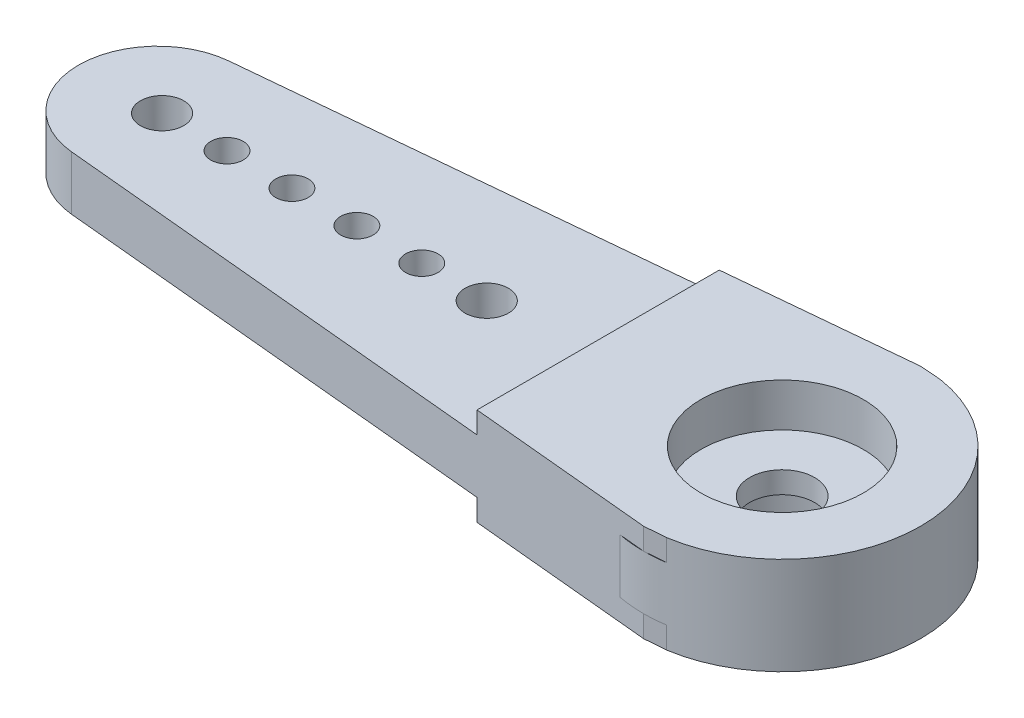
ISO-10303-21;
HEADER;
FILE_DESCRIPTION(('STEP AP214'),'2;1');
FILE_NAME('part.step','',(''),(''),'','','');
FILE_SCHEMA(('AUTOMOTIVE_DESIGN { 1 0 10303 214 1 1 1 1 }'));
ENDSEC;
DATA;
#1=APPLICATION_CONTEXT('core data for automotive mechanical design processes');
#2=APPLICATION_PROTOCOL_DEFINITION('international standard','automotive_design',2000,#1);
#3=PRODUCT_CONTEXT('',#1,'mechanical');
#4=PRODUCT('Part','Part','',(#3));
#5=PRODUCT_RELATED_PRODUCT_CATEGORY('part','',(#4));
#6=PRODUCT_DEFINITION_FORMATION('','',#4);
#7=PRODUCT_DEFINITION_CONTEXT('part definition',#1,'design');
#8=PRODUCT_DEFINITION('design','',#6,#7);
#9=PRODUCT_DEFINITION_SHAPE('','',#8);
#10=(LENGTH_UNIT() NAMED_UNIT(*) SI_UNIT(.MILLI.,.METRE.));
#11=(NAMED_UNIT(*) PLANE_ANGLE_UNIT() SI_UNIT($,.RADIAN.));
#12=(NAMED_UNIT(*) SI_UNIT($,.STERADIAN.) SOLID_ANGLE_UNIT());
#13=UNCERTAINTY_MEASURE_WITH_UNIT(LENGTH_MEASURE(1.E-05),#10,'distance_accuracy_value','');
#14=(GEOMETRIC_REPRESENTATION_CONTEXT(3) GLOBAL_UNCERTAINTY_ASSIGNED_CONTEXT((#13)) GLOBAL_UNIT_ASSIGNED_CONTEXT((#10,
#11,#12)) REPRESENTATION_CONTEXT('',''));
#15=CARTESIAN_POINT('',(0.,0.,0.));
#16=DIRECTION('',(0.,0.,1.));
#17=DIRECTION('',(1.,0.,0.));
#18=AXIS2_PLACEMENT_3D('',#15,#16,#17);
#19=CARTESIAN_POINT('',(28.85,-11.,0.));
#20=DIRECTION('',(0.,1.,0.));
#21=DIRECTION('',(0.,0.,1.));
#22=AXIS2_PLACEMENT_3D('',#19,#20,#21);
#23=CYLINDRICAL_SURFACE('',#22,1.5);
#24=CARTESIAN_POINT('',(28.85,0.5,0.));
#25=DIRECTION('',(0.,-1.,0.));
#26=DIRECTION('',(0.,0.,-1.));
#27=AXIS2_PLACEMENT_3D('',#24,#25,#26);
#28=CIRCLE('',#27,1.5);
#29=CARTESIAN_POINT('',(28.85,0.5,-1.5));
#30=VERTEX_POINT('',#29);
#31=EDGE_CURVE('E299',#30,#30,#28,.F.);
#32=ORIENTED_EDGE('',*,*,#31,.F.);
#33=EDGE_LOOP('',(#32));
#34=FACE_BOUND('',#33,.T.);
#35=CARTESIAN_POINT('',(28.85,1.5,0.));
#36=DIRECTION('',(0.,1.,0.));
#37=DIRECTION('',(0.,0.,1.));
#38=AXIS2_PLACEMENT_3D('',#35,#36,#37);
#39=CIRCLE('',#38,1.5);
#40=CARTESIAN_POINT('',(28.85,1.5,1.5));
#41=VERTEX_POINT('',#40);
#42=EDGE_CURVE('E38',#41,#41,#39,.F.);
#43=ORIENTED_EDGE('',*,*,#42,.F.);
#44=EDGE_LOOP('',(#43));
#45=FACE_BOUND('',#44,.T.);
#46=ADVANCED_FACE('F34',(#34,#45),#23,.F.);
#47=CARTESIAN_POINT('',(0.,2.5,0.));
#48=DIRECTION('',(0.,1.,0.));
#49=DIRECTION('',(0.,0.,1.));
#50=AXIS2_PLACEMENT_3D('',#47,#48,#49);
#51=PLANE('',#50);
#52=CARTESIAN_POINT('',(28.85,2.5,0.));
#53=DIRECTION('',(0.,1.,0.));
#54=DIRECTION('',(0.,0.,1.));
#55=AXIS2_PLACEMENT_3D('',#52,#53,#54);
#56=CIRCLE('',#55,6.40000000000001);
#57=CARTESIAN_POINT('',(28.85,2.5,6.40000000000001));
#58=VERTEX_POINT('',#57);
#59=CARTESIAN_POINT('',(29.8368016849677,2.5,6.32346601434253));
#60=VERTEX_POINT('',#59);
#61=EDGE_CURVE('E242',#58,#60,#56,.T.);
#62=ORIENTED_EDGE('',*,*,#61,.T.);
#63=DIRECTION('',(-0.997005908894481,0.,0.0773254009332646));
#64=VECTOR('',#63,1.);
#65=CARTESIAN_POINT('',(0.665901271094628,2.5,8.58589149243044));
#66=LINE('',#65,#64);
#67=EDGE_CURVE('E156',#60,#58,#66,.T.);
#68=ORIENTED_EDGE('',*,*,#67,.T.);
#69=EDGE_LOOP('',(#62,#68));
#70=FACE_BOUND('',#69,.T.);
#71=ADVANCED_FACE('F338',(#70),#51,.T.);
#72=DIRECTION('',(0.995540849684508,0.,0.0943314189941372));
#73=VECTOR('',#72,1.);
#74=CARTESIAN_POINT('',(-0.344309679328601,2.5,3.63372410134846));
#75=LINE('',#74,#73);
#76=CARTESIAN_POINT('',(27.6479420029777,2.5,6.28610026739908));
#77=VERTEX_POINT('',#76);
#78=EDGE_CURVE('E229',#77,#58,#75,.T.);
#79=ORIENTED_EDGE('',*,*,#78,.F.);
#80=EDGE_CURVE('E238',#77,#58,#56,.T.);
#81=ORIENTED_EDGE('',*,*,#80,.T.);
#82=EDGE_LOOP('',(#79,#81));
#83=FACE_BOUND('',#82,.T.);
#84=ADVANCED_FACE('F421',(#83),#51,.T.);
#85=CARTESIAN_POINT('',(28.85,2.5,-6.40000000000001));
#86=VERTEX_POINT('',#85);
#87=CARTESIAN_POINT('',(27.6479420029777,2.5,-6.28610026739908));
#88=VERTEX_POINT('',#87);
#89=EDGE_CURVE('E236',#86,#88,#56,.T.);
#90=ORIENTED_EDGE('',*,*,#89,.T.);
#91=DIRECTION('',(0.995540849684508,0.,-0.0943314189941372));
#92=VECTOR('',#91,1.);
#93=CARTESIAN_POINT('',(-0.344309679328601,2.5,-3.63372410134846));
#94=LINE('',#93,#92);
#95=EDGE_CURVE('E58',#88,#86,#94,.T.);
#96=ORIENTED_EDGE('',*,*,#95,.T.);
#97=EDGE_LOOP('',(#90,#96));
#98=FACE_BOUND('',#97,.T.);
#99=ADVANCED_FACE('F380',(#98),#51,.T.);
#100=CARTESIAN_POINT('',(29.8368016849677,2.5,-6.32346601434253));
#101=VERTEX_POINT('',#100);
#102=EDGE_CURVE('E378',#101,#86,#56,.T.);
#103=ORIENTED_EDGE('',*,*,#102,.T.);
#104=DIRECTION('',(0.997005908894481,0.,0.0773254009332646));
#105=VECTOR('',#104,1.);
#106=CARTESIAN_POINT('',(0.665901271094628,2.5,-8.58589149243044));
#107=LINE('',#106,#105);
#108=EDGE_CURVE('E210',#86,#101,#107,.T.);
#109=ORIENTED_EDGE('',*,*,#108,.T.);
#110=EDGE_LOOP('',(#103,#109));
#111=FACE_BOUND('',#110,.T.);
#112=ADVANCED_FACE('F339',(#111),#51,.T.);
#113=CARTESIAN_POINT('',(0.,0.,0.));
#114=DIRECTION('',(0.,1.,0.));
#115=DIRECTION('',(0.,0.,1.));
#116=AXIS2_PLACEMENT_3D('',#113,#114,#115);
#117=PLANE('',#116);
#118=DIRECTION('',(-0.997005908894481,0.,0.0773254009332646));
#119=VECTOR('',#118,1.);
#120=CARTESIAN_POINT('',(0.665901271094628,0.,8.58589149243044));
#121=LINE('',#120,#119);
#122=CARTESIAN_POINT('',(29.8368016849677,0.,6.32346601434253));
#123=VERTEX_POINT('',#122);
#124=CARTESIAN_POINT('',(28.85,0.,6.40000000000001));
#125=VERTEX_POINT('',#124);
#126=EDGE_CURVE('E43',#123,#125,#121,.T.);
#127=ORIENTED_EDGE('',*,*,#126,.F.);
#128=CARTESIAN_POINT('',(28.85,0.,0.));
#129=DIRECTION('',(0.,1.,0.));
#130=DIRECTION('',(0.,0.,1.));
#131=AXIS2_PLACEMENT_3D('',#128,#129,#130);
#132=CIRCLE('',#131,6.40000000000001);
#133=EDGE_CURVE('E253',#125,#123,#132,.T.);
#134=ORIENTED_EDGE('',*,*,#133,.F.);
#135=EDGE_LOOP('',(#127,#134));
#136=FACE_BOUND('',#135,.T.);
#137=ADVANCED_FACE('F354',(#136),#117,.F.);
#138=CARTESIAN_POINT('',(27.6479420029777,0.,6.28610026739908));
#139=VERTEX_POINT('',#138);
#140=EDGE_CURVE('E250',#139,#125,#132,.T.);
#141=ORIENTED_EDGE('',*,*,#140,.F.);
#142=DIRECTION('',(0.995540849684508,0.,0.0943314189941372));
#143=VECTOR('',#142,1.);
#144=CARTESIAN_POINT('',(-0.344309679328601,0.,3.63372410134846));
#145=LINE('',#144,#143);
#146=EDGE_CURVE('E276',#139,#125,#145,.T.);
#147=ORIENTED_EDGE('',*,*,#146,.T.);
#148=EDGE_LOOP('',(#141,#147));
#149=FACE_BOUND('',#148,.T.);
#150=ADVANCED_FACE('F408',(#149),#117,.F.);
#151=DIRECTION('',(0.995540849684508,0.,-0.0943314189941372));
#152=VECTOR('',#151,1.);
#153=CARTESIAN_POINT('',(-0.344309679328601,0.,-3.63372410134846));
#154=LINE('',#153,#152);
#155=CARTESIAN_POINT('',(27.6479420029777,0.,-6.28610026739908));
#156=VERTEX_POINT('',#155);
#157=CARTESIAN_POINT('',(28.85,0.,-6.40000000000001));
#158=VERTEX_POINT('',#157);
#159=EDGE_CURVE('E271',#156,#158,#154,.T.);
#160=ORIENTED_EDGE('',*,*,#159,.F.);
#161=EDGE_CURVE('E249',#158,#156,#132,.T.);
#162=ORIENTED_EDGE('',*,*,#161,.F.);
#163=EDGE_LOOP('',(#160,#162));
#164=FACE_BOUND('',#163,.T.);
#165=ADVANCED_FACE('F394',(#164),#117,.F.);
#166=DIRECTION('',(0.997005908894481,0.,0.0773254009332646));
#167=VECTOR('',#166,1.);
#168=CARTESIAN_POINT('',(0.665901271094628,0.,-8.58589149243044));
#169=LINE('',#168,#167);
#170=CARTESIAN_POINT('',(29.8368016849677,0.,-6.32346601434253));
#171=VERTEX_POINT('',#170);
#172=EDGE_CURVE('E268',#158,#171,#169,.T.);
#173=ORIENTED_EDGE('',*,*,#172,.F.);
#174=EDGE_CURVE('E393',#171,#158,#132,.T.);
#175=ORIENTED_EDGE('',*,*,#174,.F.);
#176=EDGE_LOOP('',(#173,#175));
#177=FACE_BOUND('',#176,.T.);
#178=ADVANCED_FACE('F355',(#177),#117,.F.);
#179=CARTESIAN_POINT('',(-0.344309679328601,2.5,3.63372410134846));
#180=DIRECTION('',(-0.0943314189941372,0.,0.995540849684508));
#181=DIRECTION('',(0.995540849684508,0.,0.0943314189941372));
#182=AXIS2_PLACEMENT_3D('',#179,#180,#181);
#183=PLANE('',#182);
#184=DIRECTION('',(-0.995540849684508,0.,-0.0943314189941372));
#185=VECTOR('',#184,1.);
#186=CARTESIAN_POINT('',(-0.344309679328601,0.,3.63372410134846));
#187=LINE('',#186,#185);
#188=CARTESIAN_POINT('',(20.35,0.,5.59459150098737));
#189=VERTEX_POINT('',#188);
#190=CARTESIAN_POINT('',(-0.344309679328601,0.,3.63372410134846));
#191=VERTEX_POINT('',#190);
#192=EDGE_CURVE('E233',#189,#191,#187,.T.);
#193=ORIENTED_EDGE('',*,*,#192,.F.);
#194=DIRECTION('',(0.,1.,0.));
#195=VECTOR('',#194,1.);
#196=CARTESIAN_POINT('',(20.35,-1.,5.59459150098737));
#197=LINE('',#196,#195);
#198=CARTESIAN_POINT('',(20.35,-1.,5.59459150098737));
#199=VERTEX_POINT('',#198);
#200=EDGE_CURVE('E212',#199,#189,#197,.T.);
#201=ORIENTED_EDGE('',*,*,#200,.F.);
#202=DIRECTION('',(0.995540849684508,0.,0.0943314189941372));
#203=VECTOR('',#202,1.);
#204=CARTESIAN_POINT('',(-0.344309679328601,-1.,3.63372410134846));
#205=LINE('',#204,#203);
#206=CARTESIAN_POINT('',(28.85,-1.,6.40000000000001));
#207=VERTEX_POINT('',#206);
#208=EDGE_CURVE('E160',#199,#207,#205,.T.);
#209=ORIENTED_EDGE('',*,*,#208,.T.);
#210=DIRECTION('',(0.,1.,0.));
#211=VECTOR('',#210,1.);
#212=CARTESIAN_POINT('',(28.85,-1.,6.40000000000001));
#213=LINE('',#212,#211);
#214=EDGE_CURVE('E207',#207,#125,#213,.T.);
#215=ORIENTED_EDGE('',*,*,#214,.T.);
#216=ORIENTED_EDGE('',*,*,#146,.F.);
#217=DIRECTION('',(0.,-1.,0.));
#218=VECTOR('',#217,1.);
#219=CARTESIAN_POINT('',(27.6479420029777,2.5,6.28610026739908));
#220=LINE('',#219,#218);
#221=EDGE_CURVE('E265',#77,#139,#220,.T.);
#222=ORIENTED_EDGE('',*,*,#221,.F.);
#223=ORIENTED_EDGE('',*,*,#78,.T.);
#224=CARTESIAN_POINT('',(28.85,3.5,6.40000000000001));
#225=VERTEX_POINT('',#224);
#226=EDGE_CURVE('E211',#58,#225,#213,.T.);
#227=ORIENTED_EDGE('',*,*,#226,.T.);
#228=DIRECTION('',(0.995540849684508,0.,0.0943314189941372));
#229=VECTOR('',#228,1.);
#230=CARTESIAN_POINT('',(-0.344309679328601,3.5,3.63372410134846));
#231=LINE('',#230,#229);
#232=CARTESIAN_POINT('',(20.35,3.5,5.59459150098737));
#233=VERTEX_POINT('',#232);
#234=EDGE_CURVE('E177',#233,#225,#231,.T.);
#235=ORIENTED_EDGE('',*,*,#234,.F.);
#236=CARTESIAN_POINT('',(20.35,2.5,5.59459150098737));
#237=VERTEX_POINT('',#236);
#238=EDGE_CURVE('E214',#237,#233,#197,.T.);
#239=ORIENTED_EDGE('',*,*,#238,.F.);
#240=DIRECTION('',(-0.995540849684508,0.,-0.0943314189941372));
#241=VECTOR('',#240,1.);
#242=CARTESIAN_POINT('',(-0.344309679328601,2.5,3.63372410134846));
#243=LINE('',#242,#241);
#244=CARTESIAN_POINT('',(-0.344309679328601,2.5,3.63372410134846));
#245=VERTEX_POINT('',#244);
#246=EDGE_CURVE('E234',#237,#245,#243,.T.);
#247=ORIENTED_EDGE('',*,*,#246,.T.);
#248=DIRECTION('',(0.,-1.,0.));
#249=VECTOR('',#248,1.);
#250=CARTESIAN_POINT('',(-0.344309679328601,2.5,3.63372410134846));
#251=LINE('',#250,#249);
#252=EDGE_CURVE('E247',#245,#191,#251,.T.);
#253=ORIENTED_EDGE('',*,*,#252,.T.);
#254=EDGE_LOOP('',(#193,#201,#209,#215,#216,#222,#223,#227,#235,#239,#247,#253));
#255=FACE_BOUND('',#254,.T.);
#256=ADVANCED_FACE('F36',(#255),#183,.T.);
#257=CARTESIAN_POINT('',(28.85,2.5,0.));
#258=DIRECTION('',(0.,-1.,0.));
#259=DIRECTION('',(0.,0.,-1.));
#260=AXIS2_PLACEMENT_3D('',#257,#258,#259);
#261=CYLINDRICAL_SURFACE('',#260,6.40000000000001);
#262=ORIENTED_EDGE('',*,*,#140,.T.);
#263=ORIENTED_EDGE('',*,*,#133,.T.);
#264=DIRECTION('',(0.,1.,0.));
#265=VECTOR('',#264,1.);
#266=CARTESIAN_POINT('',(29.8368016849677,-1.,6.32346601434253));
#267=LINE('',#266,#265);
#268=CARTESIAN_POINT('',(29.8368016849677,-1.,6.32346601434253));
#269=VERTEX_POINT('',#268);
#270=EDGE_CURVE('E159',#269,#123,#267,.T.);
#271=ORIENTED_EDGE('',*,*,#270,.F.);
#272=CARTESIAN_POINT('',(28.85,-1.,0.));
#273=DIRECTION('',(0.,1.,0.));
#274=DIRECTION('',(0.,0.,1.));
#275=AXIS2_PLACEMENT_3D('',#272,#273,#274);
#276=CIRCLE('',#275,6.40000000000001);
#277=CARTESIAN_POINT('',(29.8368016849677,-1.,-6.32346601434253));
#278=VERTEX_POINT('',#277);
#279=EDGE_CURVE('E195',#269,#278,#276,.T.);
#280=ORIENTED_EDGE('',*,*,#279,.T.);
#281=DIRECTION('',(0.,1.,0.));
#282=VECTOR('',#281,1.);
#283=CARTESIAN_POINT('',(29.8368016849677,-1.,-6.32346601434253));
#284=LINE('',#283,#282);
#285=EDGE_CURVE('E223',#278,#171,#284,.T.);
#286=ORIENTED_EDGE('',*,*,#285,.T.);
#287=ORIENTED_EDGE('',*,*,#174,.T.);
#288=ORIENTED_EDGE('',*,*,#161,.T.);
#289=DIRECTION('',(0.,-1.,0.));
#290=VECTOR('',#289,1.);
#291=CARTESIAN_POINT('',(27.6479420029777,2.5,-6.28610026739908));
#292=LINE('',#291,#290);
#293=EDGE_CURVE('E262',#88,#156,#292,.T.);
#294=ORIENTED_EDGE('',*,*,#293,.F.);
#295=ORIENTED_EDGE('',*,*,#89,.F.);
#296=ORIENTED_EDGE('',*,*,#102,.F.);
#297=CARTESIAN_POINT('',(29.8368016849677,3.5,-6.32346601434253));
#298=VERTEX_POINT('',#297);
#299=EDGE_CURVE('E167',#101,#298,#284,.T.);
#300=ORIENTED_EDGE('',*,*,#299,.T.);
#301=CARTESIAN_POINT('',(28.85,3.5,0.));
#302=DIRECTION('',(0.,1.,0.));
#303=DIRECTION('',(0.,0.,1.));
#304=AXIS2_PLACEMENT_3D('',#301,#302,#303);
#305=CIRCLE('',#304,6.40000000000001);
#306=CARTESIAN_POINT('',(29.8368016849677,3.5,6.32346601434253));
#307=VERTEX_POINT('',#306);
#308=EDGE_CURVE('E163',#307,#298,#305,.T.);
#309=ORIENTED_EDGE('',*,*,#308,.F.);
#310=EDGE_CURVE('E150',#60,#307,#267,.T.);
#311=ORIENTED_EDGE('',*,*,#310,.F.);
#312=ORIENTED_EDGE('',*,*,#61,.F.);
#313=ORIENTED_EDGE('',*,*,#80,.F.);
#314=ORIENTED_EDGE('',*,*,#221,.T.);
#315=EDGE_LOOP('',(#262,#263,#271,#280,#286,#287,#288,#294,#295,#296,#300,#309,#311,#312,#313,#314));
#316=FACE_BOUND('',#315,.T.);
#317=ADVANCED_FACE('F165',(#316),#261,.T.);
#318=CARTESIAN_POINT('',(-0.344309679328601,2.5,-3.63372410134846));
#319=DIRECTION('',(0.0943314189941372,0.,0.995540849684508));
#320=DIRECTION('',(0.995540849684508,0.,-0.0943314189941372));
#321=AXIS2_PLACEMENT_3D('',#318,#319,#320);
#322=PLANE('',#321);
#323=DIRECTION('',(-0.995540849684508,0.,0.0943314189941372));
#324=VECTOR('',#323,1.);
#325=CARTESIAN_POINT('',(-0.344309679328601,2.5,-3.63372410134846));
#326=LINE('',#325,#324);
#327=CARTESIAN_POINT('',(20.35,2.5,-5.59459150098737));
#328=VERTEX_POINT('',#327);
#329=CARTESIAN_POINT('',(-0.3443096793286,2.5,-3.63372410134846));
#330=VERTEX_POINT('',#329);
#331=EDGE_CURVE('E241',#328,#330,#326,.T.);
#332=ORIENTED_EDGE('',*,*,#331,.F.);
#333=DIRECTION('',(0.,1.,0.));
#334=VECTOR('',#333,1.);
#335=CARTESIAN_POINT('',(20.35,-1.,-5.59459150098737));
#336=LINE('',#335,#334);
#337=CARTESIAN_POINT('',(20.35,3.5,-5.59459150098737));
#338=VERTEX_POINT('',#337);
#339=EDGE_CURVE('E218',#328,#338,#336,.T.);
#340=ORIENTED_EDGE('',*,*,#339,.T.);
#341=DIRECTION('',(0.995540849684508,0.,-0.0943314189941372));
#342=VECTOR('',#341,1.);
#343=CARTESIAN_POINT('',(-0.344309679328601,3.5,-3.63372410134846));
#344=LINE('',#343,#342);
#345=CARTESIAN_POINT('',(28.85,3.5,-6.40000000000001));
#346=VERTEX_POINT('',#345);
#347=EDGE_CURVE('E187',#338,#346,#344,.T.);
#348=ORIENTED_EDGE('',*,*,#347,.T.);
#349=DIRECTION('',(0.,1.,0.));
#350=VECTOR('',#349,1.);
#351=CARTESIAN_POINT('',(28.85,-1.,-6.40000000000001));
#352=LINE('',#351,#350);
#353=EDGE_CURVE('E222',#86,#346,#352,.T.);
#354=ORIENTED_EDGE('',*,*,#353,.F.);
#355=ORIENTED_EDGE('',*,*,#95,.F.);
#356=ORIENTED_EDGE('',*,*,#293,.T.);
#357=ORIENTED_EDGE('',*,*,#159,.T.);
#358=CARTESIAN_POINT('',(28.85,-1.,-6.40000000000001));
#359=VERTEX_POINT('',#358);
#360=EDGE_CURVE('E219',#359,#158,#352,.T.);
#361=ORIENTED_EDGE('',*,*,#360,.F.);
#362=DIRECTION('',(0.995540849684508,0.,-0.0943314189941372));
#363=VECTOR('',#362,1.);
#364=CARTESIAN_POINT('',(-0.344309679328601,-1.,-3.63372410134846));
#365=LINE('',#364,#363);
#366=CARTESIAN_POINT('',(20.35,-1.,-5.59459150098737));
#367=VERTEX_POINT('',#366);
#368=EDGE_CURVE('E200',#367,#359,#365,.T.);
#369=ORIENTED_EDGE('',*,*,#368,.F.);
#370=CARTESIAN_POINT('',(20.35,0.,-5.59459150098737));
#371=VERTEX_POINT('',#370);
#372=EDGE_CURVE('E215',#367,#371,#336,.T.);
#373=ORIENTED_EDGE('',*,*,#372,.T.);
#374=DIRECTION('',(-0.995540849684508,0.,0.0943314189941372));
#375=VECTOR('',#374,1.);
#376=CARTESIAN_POINT('',(-0.344309679328601,0.,-3.63372410134846));
#377=LINE('',#376,#375);
#378=CARTESIAN_POINT('',(-0.3443096793286,0.,-3.63372410134846));
#379=VERTEX_POINT('',#378);
#380=EDGE_CURVE('E252',#371,#379,#377,.T.);
#381=ORIENTED_EDGE('',*,*,#380,.T.);
#382=DIRECTION('',(0.,-1.,0.));
#383=VECTOR('',#382,1.);
#384=CARTESIAN_POINT('',(-0.3443096793286,2.5,-3.63372410134846));
#385=LINE('',#384,#383);
#386=EDGE_CURVE('E259',#330,#379,#385,.T.);
#387=ORIENTED_EDGE('',*,*,#386,.F.);
#388=EDGE_LOOP('',(#332,#340,#348,#354,#355,#356,#357,#361,#369,#373,#381,#387));
#389=FACE_BOUND('',#388,.T.);
#390=ADVANCED_FACE('F361',(#389),#322,.F.);
#391=CARTESIAN_POINT('',(0.,2.5,0.));
#392=DIRECTION('',(0.,-1.,0.));
#393=DIRECTION('',(0.,0.,-1.));
#394=AXIS2_PLACEMENT_3D('',#391,#392,#393);
#395=CYLINDRICAL_SURFACE('',#394,3.65);
#396=CARTESIAN_POINT('',(0.,0.,0.));
#397=DIRECTION('',(0.,1.,0.));
#398=DIRECTION('',(0.,0.,1.));
#399=AXIS2_PLACEMENT_3D('',#396,#397,#398);
#400=CIRCLE('',#399,3.65);
#401=EDGE_CURVE('E237',#379,#191,#400,.T.);
#402=ORIENTED_EDGE('',*,*,#401,.T.);
#403=ORIENTED_EDGE('',*,*,#252,.F.);
#404=CARTESIAN_POINT('',(0.,2.5,0.));
#405=DIRECTION('',(0.,1.,0.));
#406=DIRECTION('',(0.,0.,1.));
#407=AXIS2_PLACEMENT_3D('',#404,#405,#406);
#408=CIRCLE('',#407,3.65);
#409=EDGE_CURVE('E244',#330,#245,#408,.T.);
#410=ORIENTED_EDGE('',*,*,#409,.F.);
#411=ORIENTED_EDGE('',*,*,#386,.T.);
#412=EDGE_LOOP('',(#402,#403,#410,#411));
#413=FACE_BOUND('',#412,.T.);
#414=ADVANCED_FACE('F335',(#413),#395,.T.);
#415=CARTESIAN_POINT('',(0.204795613183067,2.5,0.));
#416=DIRECTION('',(0.,1.,0.));
#417=DIRECTION('',(0.,0.,-1.));
#418=AXIS2_PLACEMENT_3D('',#415,#416,#417);
#419=CIRCLE('',#418,0.999999999999998);
#420=CARTESIAN_POINT('',(0.204795613183067,2.5,-0.999999999999998));
#421=VERTEX_POINT('',#420);
#422=EDGE_CURVE('E298',#421,#421,#419,.T.);
#423=ORIENTED_EDGE('',*,*,#422,.F.);
#424=EDGE_LOOP('',(#423));
#425=FACE_BOUND('',#424,.T.);
#426=CARTESIAN_POINT('',(3.20479561318307,2.5,0.));
#427=DIRECTION('',(0.,1.,0.));
#428=DIRECTION('',(0.,0.,-1.));
#429=AXIS2_PLACEMENT_3D('',#426,#427,#428);
#430=CIRCLE('',#429,0.75);
#431=CARTESIAN_POINT('',(3.20479561318307,2.5,-0.749999999999979));
#432=VERTEX_POINT('',#431);
#433=EDGE_CURVE('E295',#432,#432,#430,.T.);
#434=ORIENTED_EDGE('',*,*,#433,.F.);
#435=EDGE_LOOP('',(#434));
#436=FACE_BOUND('',#435,.T.);
#437=CARTESIAN_POINT('',(6.20479561318307,2.5,0.));
#438=DIRECTION('',(0.,1.,0.));
#439=DIRECTION('',(0.,0.,-1.));
#440=AXIS2_PLACEMENT_3D('',#437,#438,#439);
#441=CIRCLE('',#440,0.75);
#442=CARTESIAN_POINT('',(6.20479561318307,2.5,-0.749999999999958));
#443=VERTEX_POINT('',#442);
#444=EDGE_CURVE('E291',#443,#443,#441,.T.);
#445=ORIENTED_EDGE('',*,*,#444,.F.);
#446=EDGE_LOOP('',(#445));
#447=FACE_BOUND('',#446,.T.);
#448=CARTESIAN_POINT('',(9.20479561318307,2.5,0.));
#449=DIRECTION('',(0.,1.,0.));
#450=DIRECTION('',(0.,0.,-1.));
#451=AXIS2_PLACEMENT_3D('',#448,#449,#450);
#452=CIRCLE('',#451,0.75);
#453=CARTESIAN_POINT('',(9.20479561318307,2.5,-0.749999999999937));
#454=VERTEX_POINT('',#453);
#455=EDGE_CURVE('E287',#454,#454,#452,.T.);
#456=ORIENTED_EDGE('',*,*,#455,.F.);
#457=EDGE_LOOP('',(#456));
#458=FACE_BOUND('',#457,.T.);
#459=CARTESIAN_POINT('',(15.2047956131831,2.5,0.));
#460=DIRECTION('',(0.,1.,0.));
#461=DIRECTION('',(0.,0.,1.));
#462=AXIS2_PLACEMENT_3D('',#459,#460,#461);
#463=CIRCLE('',#462,1.);
#464=CARTESIAN_POINT('',(15.2047956131831,2.5,1.00000000000009));
#465=VERTEX_POINT('',#464);
#466=EDGE_CURVE('E283',#465,#465,#463,.T.);
#467=ORIENTED_EDGE('',*,*,#466,.F.);
#468=EDGE_LOOP('',(#467));
#469=FACE_BOUND('',#468,.T.);
#470=CARTESIAN_POINT('',(12.2047956131831,2.5,0.));
#471=DIRECTION('',(0.,1.,0.));
#472=DIRECTION('',(0.,0.,-1.));
#473=AXIS2_PLACEMENT_3D('',#470,#471,#472);
#474=CIRCLE('',#473,0.75);
#475=CARTESIAN_POINT('',(12.2047956131831,2.5,-0.749999999999917));
#476=VERTEX_POINT('',#475);
#477=EDGE_CURVE('E181',#476,#476,#474,.T.);
#478=ORIENTED_EDGE('',*,*,#477,.F.);
#479=EDGE_LOOP('',(#478));
#480=FACE_BOUND('',#479,.T.);
#481=DIRECTION('',(0.,0.,1.));
#482=VECTOR('',#481,1.);
#483=CARTESIAN_POINT('',(20.35,2.5,0.));
#484=LINE('',#483,#482);
#485=EDGE_CURVE('E51',#328,#237,#484,.T.);
#486=ORIENTED_EDGE('',*,*,#485,.F.);
#487=ORIENTED_EDGE('',*,*,#331,.T.);
#488=ORIENTED_EDGE('',*,*,#409,.T.);
#489=ORIENTED_EDGE('',*,*,#246,.F.);
#490=EDGE_LOOP('',(#486,#487,#488,#489));
#491=FACE_BOUND('',#490,.T.);
#492=ADVANCED_FACE('F331',(#425,#436,#447,#458,#469,#480,#491),#51,.T.);
#493=CARTESIAN_POINT('',(0.204795613183067,0.,0.));
#494=DIRECTION('',(0.,1.,0.));
#495=DIRECTION('',(0.,0.,1.));
#496=AXIS2_PLACEMENT_3D('',#493,#494,#495);
#497=CIRCLE('',#496,0.999999999999998);
#498=CARTESIAN_POINT('',(0.204795613183067,0.,0.999999999999998));
#499=VERTEX_POINT('',#498);
#500=EDGE_CURVE('E296',#499,#499,#497,.T.);
#501=ORIENTED_EDGE('',*,*,#500,.T.);
#502=EDGE_LOOP('',(#501));
#503=FACE_BOUND('',#502,.T.);
#504=CARTESIAN_POINT('',(3.20479561318307,0.,0.));
#505=DIRECTION('',(0.,1.,0.));
#506=DIRECTION('',(0.,0.,1.));
#507=AXIS2_PLACEMENT_3D('',#504,#505,#506);
#508=CIRCLE('',#507,0.75);
#509=CARTESIAN_POINT('',(3.20479561318307,0.,0.750000000000021));
#510=VERTEX_POINT('',#509);
#511=EDGE_CURVE('E292',#510,#510,#508,.T.);
#512=ORIENTED_EDGE('',*,*,#511,.T.);
#513=EDGE_LOOP('',(#512));
#514=FACE_BOUND('',#513,.T.);
#515=CARTESIAN_POINT('',(6.20479561318307,0.,0.));
#516=DIRECTION('',(0.,1.,0.));
#517=DIRECTION('',(0.,0.,1.));
#518=AXIS2_PLACEMENT_3D('',#515,#516,#517);
#519=CIRCLE('',#518,0.75);
#520=CARTESIAN_POINT('',(6.20479561318307,0.,0.750000000000042));
#521=VERTEX_POINT('',#520);
#522=EDGE_CURVE('E288',#521,#521,#519,.T.);
#523=ORIENTED_EDGE('',*,*,#522,.T.);
#524=EDGE_LOOP('',(#523));
#525=FACE_BOUND('',#524,.T.);
#526=CARTESIAN_POINT('',(9.20479561318307,0.,0.));
#527=DIRECTION('',(0.,1.,0.));
#528=DIRECTION('',(0.,0.,1.));
#529=AXIS2_PLACEMENT_3D('',#526,#527,#528);
#530=CIRCLE('',#529,0.75);
#531=CARTESIAN_POINT('',(9.20479561318307,0.,0.750000000000063));
#532=VERTEX_POINT('',#531);
#533=EDGE_CURVE('E284',#532,#532,#530,.T.);
#534=ORIENTED_EDGE('',*,*,#533,.T.);
#535=EDGE_LOOP('',(#534));
#536=FACE_BOUND('',#535,.T.);
#537=CARTESIAN_POINT('',(15.2047956131831,0.,0.));
#538=DIRECTION('',(0.,1.,0.));
#539=DIRECTION('',(0.,0.,1.));
#540=AXIS2_PLACEMENT_3D('',#537,#538,#539);
#541=CIRCLE('',#540,1.);
#542=CARTESIAN_POINT('',(15.2047956131831,0.,1.00000000000009));
#543=VERTEX_POINT('',#542);
#544=EDGE_CURVE('E280',#543,#543,#541,.T.);
#545=ORIENTED_EDGE('',*,*,#544,.T.);
#546=EDGE_LOOP('',(#545));
#547=FACE_BOUND('',#546,.T.);
#548=CARTESIAN_POINT('',(12.2047956131831,0.,0.));
#549=DIRECTION('',(0.,1.,0.));
#550=DIRECTION('',(0.,0.,1.));
#551=AXIS2_PLACEMENT_3D('',#548,#549,#550);
#552=CIRCLE('',#551,0.75);
#553=CARTESIAN_POINT('',(12.2047956131831,0.,0.750000000000084));
#554=VERTEX_POINT('',#553);
#555=EDGE_CURVE('E178',#554,#554,#552,.T.);
#556=ORIENTED_EDGE('',*,*,#555,.T.);
#557=EDGE_LOOP('',(#556));
#558=FACE_BOUND('',#557,.T.);
#559=ORIENTED_EDGE('',*,*,#380,.F.);
#560=DIRECTION('',(0.,0.,1.));
#561=VECTOR('',#560,1.);
#562=CARTESIAN_POINT('',(20.35,0.,0.));
#563=LINE('',#562,#561);
#564=EDGE_CURVE('E273',#371,#189,#563,.T.);
#565=ORIENTED_EDGE('',*,*,#564,.T.);
#566=ORIENTED_EDGE('',*,*,#192,.T.);
#567=ORIENTED_EDGE('',*,*,#401,.F.);
#568=EDGE_LOOP('',(#559,#565,#566,#567));
#569=FACE_BOUND('',#568,.T.);
#570=ADVANCED_FACE('F334',(#503,#514,#525,#536,#547,#558,#569),#117,.F.);
#571=CARTESIAN_POINT('',(0.,-1.,0.));
#572=DIRECTION('',(0.,1.,0.));
#573=DIRECTION('',(0.,0.,1.));
#574=AXIS2_PLACEMENT_3D('',#571,#572,#573);
#575=PLANE('',#574);
#576=CARTESIAN_POINT('',(28.85,-1.,0.));
#577=DIRECTION('',(0.,1.,0.));
#578=DIRECTION('',(0.,0.,1.));
#579=AXIS2_PLACEMENT_3D('',#576,#577,#578);
#580=CIRCLE('',#579,4.75);
#581=CARTESIAN_POINT('',(28.85,-1.,4.75));
#582=VERTEX_POINT('',#581);
#583=EDGE_CURVE('E11',#582,#582,#580,.F.);
#584=ORIENTED_EDGE('',*,*,#583,.F.);
#585=EDGE_LOOP('',(#584));
#586=FACE_BOUND('',#585,.T.);
#587=DIRECTION('',(-0.997005908894481,0.,0.0773254009332646));
#588=VECTOR('',#587,1.);
#589=CARTESIAN_POINT('',(0.665901271094628,-1.,8.58589149243044));
#590=LINE('',#589,#588);
#591=EDGE_CURVE('E193',#269,#207,#590,.T.);
#592=ORIENTED_EDGE('',*,*,#591,.T.);
#593=ORIENTED_EDGE('',*,*,#208,.F.);
#594=DIRECTION('',(0.,0.,1.));
#595=VECTOR('',#594,1.);
#596=CARTESIAN_POINT('',(20.35,-1.,0.));
#597=LINE('',#596,#595);
#598=EDGE_CURVE('E202',#367,#199,#597,.T.);
#599=ORIENTED_EDGE('',*,*,#598,.F.);
#600=ORIENTED_EDGE('',*,*,#368,.T.);
#601=DIRECTION('',(0.997005908894481,0.,0.0773254009332646));
#602=VECTOR('',#601,1.);
#603=CARTESIAN_POINT('',(0.665901271094628,-1.,-8.58589149243044));
#604=LINE('',#603,#602);
#605=EDGE_CURVE('E198',#359,#278,#604,.T.);
#606=ORIENTED_EDGE('',*,*,#605,.T.);
#607=ORIENTED_EDGE('',*,*,#279,.F.);
#608=EDGE_LOOP('',(#592,#593,#599,#600,#606,#607));
#609=FACE_BOUND('',#608,.T.);
#610=ADVANCED_FACE('F351',(#586,#609),#575,.F.);
#611=CARTESIAN_POINT('',(0.665901271094628,-1.,-8.58589149243044));
#612=DIRECTION('',(-0.0773254009332646,0.,0.997005908894481));
#613=DIRECTION('',(0.997005908894481,0.,0.0773254009332646));
#614=AXIS2_PLACEMENT_3D('',#611,#612,#613);
#615=PLANE('',#614);
#616=ORIENTED_EDGE('',*,*,#360,.T.);
#617=ORIENTED_EDGE('',*,*,#172,.T.);
#618=ORIENTED_EDGE('',*,*,#285,.F.);
#619=ORIENTED_EDGE('',*,*,#605,.F.);
#620=EDGE_LOOP('',(#616,#617,#618,#619));
#621=FACE_BOUND('',#620,.T.);
#622=ADVANCED_FACE('F389',(#621),#615,.F.);
#623=CARTESIAN_POINT('',(20.35,-1.,0.));
#624=DIRECTION('',(-1.,0.,0.));
#625=DIRECTION('',(0.,0.,1.));
#626=AXIS2_PLACEMENT_3D('',#623,#624,#625);
#627=PLANE('',#626);
#628=ORIENTED_EDGE('',*,*,#564,.F.);
#629=ORIENTED_EDGE('',*,*,#372,.F.);
#630=ORIENTED_EDGE('',*,*,#598,.T.);
#631=ORIENTED_EDGE('',*,*,#200,.T.);
#632=EDGE_LOOP('',(#628,#629,#630,#631));
#633=FACE_BOUND('',#632,.T.);
#634=ADVANCED_FACE('F434',(#633),#627,.T.);
#635=CARTESIAN_POINT('',(0.665901271094628,-1.,8.58589149243044));
#636=DIRECTION('',(-0.0773254009332646,0.,-0.997005908894481));
#637=DIRECTION('',(-0.997005908894481,0.,0.0773254009332646));
#638=AXIS2_PLACEMENT_3D('',#635,#636,#637);
#639=PLANE('',#638);
#640=ORIENTED_EDGE('',*,*,#270,.T.);
#641=ORIENTED_EDGE('',*,*,#126,.T.);
#642=ORIENTED_EDGE('',*,*,#214,.F.);
#643=ORIENTED_EDGE('',*,*,#591,.F.);
#644=EDGE_LOOP('',(#640,#641,#642,#643));
#645=FACE_BOUND('',#644,.T.);
#646=ADVANCED_FACE('F403',(#645),#639,.F.);
#647=ORIENTED_EDGE('',*,*,#67,.F.);
#648=ORIENTED_EDGE('',*,*,#310,.T.);
#649=DIRECTION('',(-0.997005908894481,0.,0.0773254009332646));
#650=VECTOR('',#649,1.);
#651=CARTESIAN_POINT('',(0.665901271094628,3.5,8.58589149243044));
#652=LINE('',#651,#650);
#653=EDGE_CURVE('E155',#307,#225,#652,.T.);
#654=ORIENTED_EDGE('',*,*,#653,.T.);
#655=ORIENTED_EDGE('',*,*,#226,.F.);
#656=EDGE_LOOP('',(#647,#648,#654,#655));
#657=FACE_BOUND('',#656,.T.);
#658=ADVANCED_FACE('F152',(#657),#639,.F.);
#659=ORIENTED_EDGE('',*,*,#339,.F.);
#660=ORIENTED_EDGE('',*,*,#485,.T.);
#661=ORIENTED_EDGE('',*,*,#238,.T.);
#662=DIRECTION('',(0.,0.,1.));
#663=VECTOR('',#662,1.);
#664=CARTESIAN_POINT('',(20.35,3.5,0.));
#665=LINE('',#664,#663);
#666=EDGE_CURVE('E190',#338,#233,#665,.T.);
#667=ORIENTED_EDGE('',*,*,#666,.F.);
#668=EDGE_LOOP('',(#659,#660,#661,#667));
#669=FACE_BOUND('',#668,.T.);
#670=ADVANCED_FACE('F369',(#669),#627,.T.);
#671=ORIENTED_EDGE('',*,*,#108,.F.);
#672=ORIENTED_EDGE('',*,*,#353,.T.);
#673=DIRECTION('',(0.997005908894481,0.,0.0773254009332646));
#674=VECTOR('',#673,1.);
#675=CARTESIAN_POINT('',(0.665901271094628,3.5,-8.58589149243044));
#676=LINE('',#675,#674);
#677=EDGE_CURVE('E171',#346,#298,#676,.T.);
#678=ORIENTED_EDGE('',*,*,#677,.T.);
#679=ORIENTED_EDGE('',*,*,#299,.F.);
#680=EDGE_LOOP('',(#671,#672,#678,#679));
#681=FACE_BOUND('',#680,.T.);
#682=ADVANCED_FACE('F375',(#681),#615,.F.);
#683=CARTESIAN_POINT('',(0.,3.5,0.));
#684=DIRECTION('',(0.,1.,0.));
#685=DIRECTION('',(0.,0.,1.));
#686=AXIS2_PLACEMENT_3D('',#683,#684,#685);
#687=PLANE('',#686);
#688=CARTESIAN_POINT('',(28.85,3.5,0.));
#689=DIRECTION('',(0.,1.,0.));
#690=DIRECTION('',(0.,0.,1.));
#691=AXIS2_PLACEMENT_3D('',#688,#689,#690);
#692=CIRCLE('',#691,3.75000000000001);
#693=CARTESIAN_POINT('',(28.85,3.5,3.75000000000001));
#694=VERTEX_POINT('',#693);
#695=EDGE_CURVE('E315',#694,#694,#692,.T.);
#696=ORIENTED_EDGE('',*,*,#695,.F.);
#697=EDGE_LOOP('',(#696));
#698=FACE_BOUND('',#697,.T.);
#699=ORIENTED_EDGE('',*,*,#653,.F.);
#700=ORIENTED_EDGE('',*,*,#308,.T.);
#701=ORIENTED_EDGE('',*,*,#677,.F.);
#702=ORIENTED_EDGE('',*,*,#347,.F.);
#703=ORIENTED_EDGE('',*,*,#666,.T.);
#704=ORIENTED_EDGE('',*,*,#234,.T.);
#705=EDGE_LOOP('',(#699,#700,#701,#702,#703,#704));
#706=FACE_BOUND('',#705,.T.);
#707=ADVANCED_FACE('F174',(#698,#706),#687,.T.);
#708=CARTESIAN_POINT('',(12.2047956131831,-0.5,0.));
#709=DIRECTION('',(0.,1.,0.));
#710=DIRECTION('',(0.,0.,1.));
#711=AXIS2_PLACEMENT_3D('',#708,#709,#710);
#712=CYLINDRICAL_SURFACE('',#711,0.75);
#713=ORIENTED_EDGE('',*,*,#477,.T.);
#714=EDGE_LOOP('',(#713));
#715=FACE_BOUND('',#714,.T.);
#716=ORIENTED_EDGE('',*,*,#555,.F.);
#717=EDGE_LOOP('',(#716));
#718=FACE_BOUND('',#717,.T.);
#719=ADVANCED_FACE('F343',(#715,#718),#712,.F.);
#720=CARTESIAN_POINT('',(15.2047956131831,-0.5,0.));
#721=DIRECTION('',(0.,1.,0.));
#722=DIRECTION('',(0.,0.,1.));
#723=AXIS2_PLACEMENT_3D('',#720,#721,#722);
#724=CYLINDRICAL_SURFACE('',#723,1.);
#725=ORIENTED_EDGE('',*,*,#466,.T.);
#726=EDGE_LOOP('',(#725));
#727=FACE_BOUND('',#726,.T.);
#728=ORIENTED_EDGE('',*,*,#544,.F.);
#729=EDGE_LOOP('',(#728));
#730=FACE_BOUND('',#729,.T.);
#731=ADVANCED_FACE('F328',(#727,#730),#724,.F.);
#732=CARTESIAN_POINT('',(9.20479561318307,-0.5,0.));
#733=DIRECTION('',(0.,1.,0.));
#734=DIRECTION('',(0.,0.,1.));
#735=AXIS2_PLACEMENT_3D('',#732,#733,#734);
#736=CYLINDRICAL_SURFACE('',#735,0.75);
#737=ORIENTED_EDGE('',*,*,#455,.T.);
#738=EDGE_LOOP('',(#737));
#739=FACE_BOUND('',#738,.T.);
#740=ORIENTED_EDGE('',*,*,#533,.F.);
#741=EDGE_LOOP('',(#740));
#742=FACE_BOUND('',#741,.T.);
#743=ADVANCED_FACE('F578',(#739,#742),#736,.F.);
#744=CARTESIAN_POINT('',(6.20479561318307,-0.5,0.));
#745=DIRECTION('',(0.,1.,0.));
#746=DIRECTION('',(0.,0.,1.));
#747=AXIS2_PLACEMENT_3D('',#744,#745,#746);
#748=CYLINDRICAL_SURFACE('',#747,0.75);
#749=ORIENTED_EDGE('',*,*,#444,.T.);
#750=EDGE_LOOP('',(#749));
#751=FACE_BOUND('',#750,.T.);
#752=ORIENTED_EDGE('',*,*,#522,.F.);
#753=EDGE_LOOP('',(#752));
#754=FACE_BOUND('',#753,.T.);
#755=ADVANCED_FACE('F586',(#751,#754),#748,.F.);
#756=CARTESIAN_POINT('',(3.20479561318307,-0.5,0.));
#757=DIRECTION('',(0.,1.,0.));
#758=DIRECTION('',(0.,0.,1.));
#759=AXIS2_PLACEMENT_3D('',#756,#757,#758);
#760=CYLINDRICAL_SURFACE('',#759,0.75);
#761=ORIENTED_EDGE('',*,*,#433,.T.);
#762=EDGE_LOOP('',(#761));
#763=FACE_BOUND('',#762,.T.);
#764=ORIENTED_EDGE('',*,*,#511,.F.);
#765=EDGE_LOOP('',(#764));
#766=FACE_BOUND('',#765,.T.);
#767=ADVANCED_FACE('F596',(#763,#766),#760,.F.);
#768=CARTESIAN_POINT('',(0.204795613183067,-0.5,0.));
#769=DIRECTION('',(0.,1.,0.));
#770=DIRECTION('',(0.,0.,1.));
#771=AXIS2_PLACEMENT_3D('',#768,#769,#770);
#772=CYLINDRICAL_SURFACE('',#771,0.999999999999998);
#773=ORIENTED_EDGE('',*,*,#422,.T.);
#774=EDGE_LOOP('',(#773));
#775=FACE_BOUND('',#774,.T.);
#776=ORIENTED_EDGE('',*,*,#500,.F.);
#777=EDGE_LOOP('',(#776));
#778=FACE_BOUND('',#777,.T.);
#779=ADVANCED_FACE('F606',(#775,#778),#772,.F.);
#780=CARTESIAN_POINT('',(28.85,-1.,0.));
#781=DIRECTION('',(0.,1.,0.));
#782=DIRECTION('',(0.,0.,-1.));
#783=AXIS2_PLACEMENT_3D('',#780,#781,#782);
#784=CONICAL_SURFACE('',#783,4.75,0.401425727958696);
#785=CARTESIAN_POINT('',(28.85,-2.5,0.));
#786=DIRECTION('',(0.,-1.,0.));
#787=DIRECTION('',(0.,0.,-1.));
#788=AXIS2_PLACEMENT_3D('',#785,#786,#787);
#789=CIRCLE('',#788,4.11328777568559);
#790=CARTESIAN_POINT('',(28.85,-2.5,-4.11328777568559));
#791=VERTEX_POINT('',#790);
#792=EDGE_CURVE('E301',#791,#791,#789,.T.);
#793=ORIENTED_EDGE('',*,*,#792,.F.);
#794=EDGE_LOOP('',(#793));
#795=FACE_BOUND('',#794,.T.);
#796=ORIENTED_EDGE('',*,*,#583,.T.);
#797=EDGE_LOOP('',(#796));
#798=FACE_BOUND('',#797,.T.);
#799=ADVANCED_FACE('F616',(#795,#798),#784,.T.);
#800=CARTESIAN_POINT('',(28.85,-2.5,0.));
#801=DIRECTION('',(0.,-1.,0.));
#802=DIRECTION('',(0.,0.,-1.));
#803=AXIS2_PLACEMENT_3D('',#800,#801,#802);
#804=PLANE('',#803);
#805=CARTESIAN_POINT('',(28.85,-2.5,0.));
#806=DIRECTION('',(0.,-1.,0.));
#807=DIRECTION('',(0.,0.,-1.));
#808=AXIS2_PLACEMENT_3D('',#805,#806,#807);
#809=CIRCLE('',#808,3.25);
#810=CARTESIAN_POINT('',(28.85,-2.5,-3.25));
#811=VERTEX_POINT('',#810);
#812=EDGE_CURVE('E308',#811,#811,#809,.T.);
#813=ORIENTED_EDGE('',*,*,#812,.F.);
#814=EDGE_LOOP('',(#813));
#815=FACE_BOUND('',#814,.T.);
#816=ORIENTED_EDGE('',*,*,#792,.T.);
#817=EDGE_LOOP('',(#816));
#818=FACE_BOUND('',#817,.T.);
#819=ADVANCED_FACE('F631',(#815,#818),#804,.T.);
#820=CARTESIAN_POINT('',(28.85,0.5,0.));
#821=DIRECTION('',(0.,-1.,0.));
#822=DIRECTION('',(0.,0.,-1.));
#823=AXIS2_PLACEMENT_3D('',#820,#821,#822);
#824=PLANE('',#823);
#825=CARTESIAN_POINT('',(28.85,0.5,0.));
#826=DIRECTION('',(0.,-1.,0.));
#827=DIRECTION('',(0.,0.,-1.));
#828=AXIS2_PLACEMENT_3D('',#825,#826,#827);
#829=CIRCLE('',#828,3.25);
#830=CARTESIAN_POINT('',(28.85,0.5,-3.25));
#831=VERTEX_POINT('',#830);
#832=EDGE_CURVE('E302',#831,#831,#829,.T.);
#833=ORIENTED_EDGE('',*,*,#832,.T.);
#834=EDGE_LOOP('',(#833));
#835=FACE_BOUND('',#834,.T.);
#836=ORIENTED_EDGE('',*,*,#31,.T.);
#837=EDGE_LOOP('',(#836));
#838=FACE_BOUND('',#837,.T.);
#839=ADVANCED_FACE('F641',(#835,#838),#824,.T.);
#840=CARTESIAN_POINT('',(28.85,0.5,0.));
#841=DIRECTION('',(0.,-1.,0.));
#842=DIRECTION('',(0.,0.,-1.));
#843=AXIS2_PLACEMENT_3D('',#840,#841,#842);
#844=CYLINDRICAL_SURFACE('',#843,3.25);
#845=ORIENTED_EDGE('',*,*,#832,.F.);
#846=EDGE_LOOP('',(#845));
#847=FACE_BOUND('',#846,.T.);
#848=ORIENTED_EDGE('',*,*,#812,.T.);
#849=EDGE_LOOP('',(#848));
#850=FACE_BOUND('',#849,.T.);
#851=ADVANCED_FACE('F651',(#847,#850),#844,.F.);
#852=CARTESIAN_POINT('',(28.85,1.5,0.));
#853=DIRECTION('',(0.,1.,0.));
#854=DIRECTION('',(0.,0.,1.));
#855=AXIS2_PLACEMENT_3D('',#852,#853,#854);
#856=PLANE('',#855);
#857=CARTESIAN_POINT('',(28.85,1.5,0.));
#858=DIRECTION('',(0.,1.,0.));
#859=DIRECTION('',(0.,0.,1.));
#860=AXIS2_PLACEMENT_3D('',#857,#858,#859);
#861=CIRCLE('',#860,3.75000000000001);
#862=CARTESIAN_POINT('',(28.85,1.5,3.75000000000001));
#863=VERTEX_POINT('',#862);
#864=EDGE_CURVE('E696',#863,#863,#861,.T.);
#865=ORIENTED_EDGE('',*,*,#864,.T.);
#866=EDGE_LOOP('',(#865));
#867=FACE_BOUND('',#866,.T.);
#868=ORIENTED_EDGE('',*,*,#42,.T.);
#869=EDGE_LOOP('',(#868));
#870=FACE_BOUND('',#869,.T.);
#871=ADVANCED_FACE('F659',(#867,#870),#856,.T.);
#872=CARTESIAN_POINT('',(28.85,1.5,0.));
#873=DIRECTION('',(0.,1.,0.));
#874=DIRECTION('',(0.,0.,1.));
#875=AXIS2_PLACEMENT_3D('',#872,#873,#874);
#876=CYLINDRICAL_SURFACE('',#875,3.75000000000001);
#877=ORIENTED_EDGE('',*,*,#864,.F.);
#878=EDGE_LOOP('',(#877));
#879=FACE_BOUND('',#878,.T.);
#880=ORIENTED_EDGE('',*,*,#695,.T.);
#881=EDGE_LOOP('',(#880));
#882=FACE_BOUND('',#881,.T.);
#883=ADVANCED_FACE('F679',(#879,#882),#876,.F.);
#884=CLOSED_SHELL('',(#46,#71,#84,#99,#112,#137,#150,#165,#178,#256,#317,#390,#414,#492,#570,
#610,#622,#634,#646,#658,#670,#682,#707,#719,#731,#743,#755,#767,#779,#799,#819,#839,#851,#871,#883));
#885=MANIFOLD_SOLID_BREP('B2',#884);
#886=ADVANCED_BREP_SHAPE_REPRESENTATION('',(#18,#885),#14);
#887=SHAPE_DEFINITION_REPRESENTATION(#9,#886);
ENDSEC;
END-ISO-10303-21;
